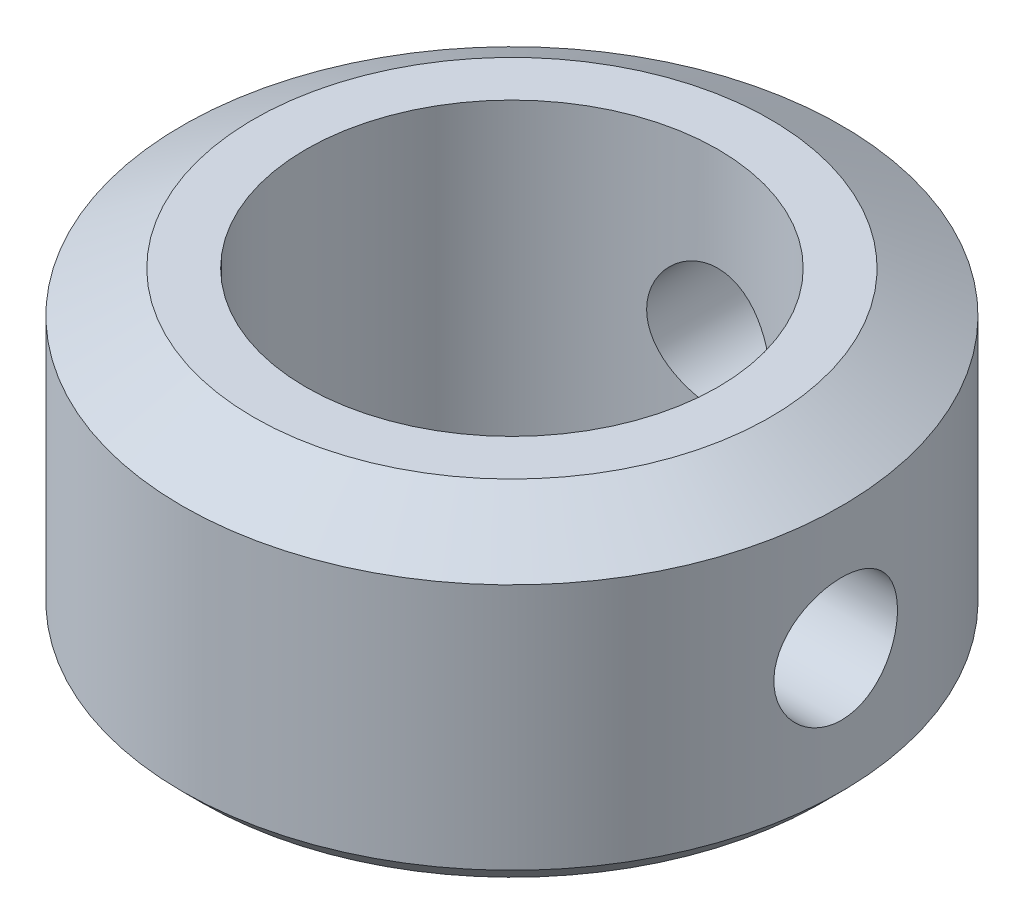
ISO-10303-21;
HEADER;
FILE_DESCRIPTION(('STEP AP214'),'2;1');
FILE_NAME('part.step','',(''),(''),'','','');
FILE_SCHEMA(('AUTOMOTIVE_DESIGN { 1 0 10303 214 1 1 1 1 }'));
ENDSEC;
DATA;
#1=APPLICATION_CONTEXT('core data for automotive mechanical design processes');
#2=APPLICATION_PROTOCOL_DEFINITION('international standard','automotive_design',2000,#1);
#3=PRODUCT_CONTEXT('',#1,'mechanical');
#4=PRODUCT('Part','Part','',(#3));
#5=PRODUCT_RELATED_PRODUCT_CATEGORY('part','',(#4));
#6=PRODUCT_DEFINITION_FORMATION('','',#4);
#7=PRODUCT_DEFINITION_CONTEXT('part definition',#1,'design');
#8=PRODUCT_DEFINITION('design','',#6,#7);
#9=PRODUCT_DEFINITION_SHAPE('','',#8);
#10=(LENGTH_UNIT() NAMED_UNIT(*) SI_UNIT(.MILLI.,.METRE.));
#11=(NAMED_UNIT(*) PLANE_ANGLE_UNIT() SI_UNIT($,.RADIAN.));
#12=(NAMED_UNIT(*) SI_UNIT($,.STERADIAN.) SOLID_ANGLE_UNIT());
#13=UNCERTAINTY_MEASURE_WITH_UNIT(LENGTH_MEASURE(1.E-05),#10,'distance_accuracy_value','');
#14=(GEOMETRIC_REPRESENTATION_CONTEXT(3) GLOBAL_UNCERTAINTY_ASSIGNED_CONTEXT((#13)) GLOBAL_UNIT_ASSIGNED_CONTEXT((#10,
#11,#12)) REPRESENTATION_CONTEXT('',''));
#15=CARTESIAN_POINT('',(0.,0.,0.));
#16=DIRECTION('',(0.,0.,1.));
#17=DIRECTION('',(1.,0.,0.));
#18=AXIS2_PLACEMENT_3D('',#15,#16,#17);
#19=CARTESIAN_POINT('',(0.,7.5,0.));
#20=DIRECTION('',(0.,1.,0.));
#21=DIRECTION('',(0.,0.,1.));
#22=AXIS2_PLACEMENT_3D('',#19,#20,#21);
#23=PLANE('',#22);
#24=CARTESIAN_POINT('',(0.,7.5,0.));
#25=DIRECTION('',(0.,1.,0.));
#26=DIRECTION('',(0.,0.,1.));
#27=AXIS2_PLACEMENT_3D('',#24,#25,#26);
#28=CIRCLE('',#27,6.26794919243112);
#29=CARTESIAN_POINT('',(0.,7.5,6.26794919243112));
#30=VERTEX_POINT('',#29);
#31=EDGE_CURVE('E54',#30,#30,#28,.T.);
#32=ORIENTED_EDGE('',*,*,#31,.T.);
#33=EDGE_LOOP('',(#32));
#34=FACE_BOUND('',#33,.T.);
#35=CARTESIAN_POINT('',(0.,7.5,0.));
#36=DIRECTION('',(0.,1.,0.));
#37=DIRECTION('',(0.,0.,1.));
#38=AXIS2_PLACEMENT_3D('',#35,#36,#37);
#39=CIRCLE('',#38,5.);
#40=CARTESIAN_POINT('',(0.,7.5,5.));
#41=VERTEX_POINT('',#40);
#42=EDGE_CURVE('E57',#41,#41,#39,.T.);
#43=ORIENTED_EDGE('',*,*,#42,.F.);
#44=EDGE_LOOP('',(#43));
#45=FACE_BOUND('',#44,.T.);
#46=ADVANCED_FACE('F31',(#34,#45),#23,.T.);
#47=CARTESIAN_POINT('',(0.,0.,0.));
#48=DIRECTION('',(0.,1.,0.));
#49=DIRECTION('',(0.,0.,1.));
#50=AXIS2_PLACEMENT_3D('',#47,#48,#49);
#51=PLANE('',#50);
#52=CARTESIAN_POINT('',(0.,0.,0.));
#53=DIRECTION('',(0.,1.,0.));
#54=DIRECTION('',(0.,0.,1.));
#55=AXIS2_PLACEMENT_3D('',#52,#53,#54);
#56=CIRCLE('',#55,5.2);
#57=CARTESIAN_POINT('',(0.,0.,5.2));
#58=VERTEX_POINT('',#57);
#59=EDGE_CURVE('E38',#58,#58,#56,.T.);
#60=ORIENTED_EDGE('',*,*,#59,.T.);
#61=EDGE_LOOP('',(#60));
#62=FACE_BOUND('',#61,.T.);
#63=CARTESIAN_POINT('',(0.,0.,0.));
#64=DIRECTION('',(0.,1.,0.));
#65=DIRECTION('',(0.,0.,1.));
#66=AXIS2_PLACEMENT_3D('',#63,#64,#65);
#67=CIRCLE('',#66,7.5);
#68=CARTESIAN_POINT('',(0.,0.,7.5));
#69=VERTEX_POINT('',#68);
#70=EDGE_CURVE('E42',#69,#69,#67,.F.);
#71=ORIENTED_EDGE('',*,*,#70,.T.);
#72=EDGE_LOOP('',(#71));
#73=FACE_BOUND('',#72,.T.);
#74=ADVANCED_FACE('F106',(#62,#73),#51,.F.);
#75=CARTESIAN_POINT('',(0.,7.5,0.));
#76=DIRECTION('',(0.,-1.,0.));
#77=DIRECTION('',(0.,0.,-1.));
#78=AXIS2_PLACEMENT_3D('',#75,#76,#77);
#79=CYLINDRICAL_SURFACE('',#78,8.);
#80=CARTESIAN_POINT('',(-1.50000000000003,3.5,-7.85811682275085));
#81=CARTESIAN_POINT('',(-1.49999679883248,3.58345720801174,-7.85811843793493));
#82=CARTESIAN_POINT('',(-1.49301126348939,3.66695594821839,-7.85946079760266));
#83=CARTESIAN_POINT('',(-1.46527253251808,3.83159896158191,-7.86467851014364));
#84=CARTESIAN_POINT('',(-1.4445076576848,3.91274117642748,-7.86855601173205));
#85=CARTESIAN_POINT('',(-1.3898703561779,4.07026507137087,-7.87838976464884));
#86=CARTESIAN_POINT('',(-1.35601013954377,4.14665110930729,-7.88434407905997));
#87=CARTESIAN_POINT('',(-1.27617565760369,4.29265355928681,-7.89765826320959));
#88=CARTESIAN_POINT('',(-1.23020233759196,4.3622704990033,-7.90501802325621));
#89=CARTESIAN_POINT('',(-1.12683678942625,4.49363019919913,-7.92041614838944));
#90=CARTESIAN_POINT('',(-1.06932292933094,4.55527648347173,-7.92846116625679));
#91=CARTESIAN_POINT('',(-0.944771778803578,4.66810438959956,-7.94426457664033));
#92=CARTESIAN_POINT('',(-0.877733863624972,4.71928532442479,-7.95202295031152));
#93=CARTESIAN_POINT('',(-0.735403894570189,4.81009937660052,-7.96645017828405));
#94=CARTESIAN_POINT('',(-0.660052840033892,4.84964153351942,-7.97311028052363));
#95=CARTESIAN_POINT('',(-0.503631283250789,4.91546954227353,-7.9845160863293));
#96=CARTESIAN_POINT('',(-0.422561251859532,4.94175648399022,-7.98926194728334));
#97=CARTESIAN_POINT('',(-0.258002746187443,4.98002954861113,-7.99625755123778));
#98=CARTESIAN_POINT('',(-0.174553323244884,4.99217830592268,-7.99853565976327));
#99=CARTESIAN_POINT('',(-0.00677167603540987,5.0023368877004,-8.00043684615594));
#100=CARTESIAN_POINT('',(0.0775604724476434,5.00034791613906,-8.00006015010697));
#101=CARTESIAN_POINT('',(0.24359835789937,4.98241222885285,-7.99671633763241));
#102=CARTESIAN_POINT('',(0.325323760451442,4.96664063056999,-7.99378172247214));
#103=CARTESIAN_POINT('',(0.484947165715449,4.92186435060476,-7.98568826333561));
#104=CARTESIAN_POINT('',(0.562845028826514,4.89285918665419,-7.98052933829966));
#105=CARTESIAN_POINT('',(0.713110065751494,4.8222722689417,-7.9685126029734));
#106=CARTESIAN_POINT('',(0.785443571838506,4.7806205120875,-7.96164537590826));
#107=CARTESIAN_POINT('',(0.922159977214611,4.68597433092284,-7.9469714754285));
#108=CARTESIAN_POINT('',(0.986542066910758,4.63297875311242,-7.93916470651164));
#109=CARTESIAN_POINT('',(1.10656561896901,4.51618429701647,-7.92333513680567));
#110=CARTESIAN_POINT('',(1.16205790757039,4.45223221609792,-7.91531085901622));
#111=CARTESIAN_POINT('',(1.26155171851258,4.31585046872137,-7.90006508924621));
#112=CARTESIAN_POINT('',(1.30555307271179,4.24342067823536,-7.89284360901351));
#113=CARTESIAN_POINT('',(1.38085852224475,4.09194172929734,-7.88001893307122));
#114=CARTESIAN_POINT('',(1.41214093645419,4.01288154280935,-7.87441850530262));
#115=CARTESIAN_POINT('',(1.46093656975053,3.8504988158768,-7.8655124239669));
#116=CARTESIAN_POINT('',(1.47845134901105,3.76717675953521,-7.8622065103862));
#117=CARTESIAN_POINT('',(1.49899672649736,3.59998067114412,-7.85831520301006));
#118=CARTESIAN_POINT('',(1.50224164285856,3.51613388443448,-7.85768955816137));
#119=CARTESIAN_POINT('',(1.49472968881722,3.34909654491285,-7.85912191420841));
#120=CARTESIAN_POINT('',(1.4839735108643,3.26590595985191,-7.86117978238612));
#121=CARTESIAN_POINT('',(1.4489486819588,3.10324709694561,-7.86770980063206));
#122=CARTESIAN_POINT('',(1.42479238583987,3.0237537473751,-7.87216186690879));
#123=CARTESIAN_POINT('',(1.36377224379057,2.86994281026984,-7.88296134156619));
#124=CARTESIAN_POINT('',(1.32690746128792,2.79562560468467,-7.88930888963282));
#125=CARTESIAN_POINT('',(1.24102353119657,2.65333238095683,-7.90327577863686));
#126=CARTESIAN_POINT('',(1.19186899639618,2.58543946213392,-7.91090895425316));
#127=CARTESIAN_POINT('',(1.08298344344244,2.45878795978567,-7.92654811368101));
#128=CARTESIAN_POINT('',(1.02325147433081,2.40003019844422,-7.93455413096494));
#129=CARTESIAN_POINT('',(0.893949417870357,2.29251623646587,-7.95016624005946));
#130=CARTESIAN_POINT('',(0.824258534095862,2.24390417339403,-7.95776555833305));
#131=CARTESIAN_POINT('',(0.677574523040111,2.15907879382233,-7.97159404810351));
#132=CARTESIAN_POINT('',(0.6005816770385,2.12286499997499,-7.97782327234725));
#133=CARTESIAN_POINT('',(0.441877541578655,2.06407990213592,-7.98818057995848));
#134=CARTESIAN_POINT('',(0.360193213078959,2.04143781243859,-7.99231954730142));
#135=CARTESIAN_POINT('',(0.194096227381542,2.01021295171011,-7.99807642083745));
#136=CARTESIAN_POINT('',(0.109683858215822,2.00162870133729,-7.99969459229933));
#137=CARTESIAN_POINT('',(-0.058090760250538,1.99881469848156,-8.00022227515441));
#138=CARTESIAN_POINT('',(-0.141449307066297,2.00436724687047,-7.99917286625032));
#139=CARTESIAN_POINT('',(-0.306023369279228,2.02919242776843,-7.99456866611703));
#140=CARTESIAN_POINT('',(-0.387238905213718,2.04846492874421,-7.99101389890671));
#141=CARTESIAN_POINT('',(-0.545106475595513,2.10009120738372,-7.98179837978045));
#142=CARTESIAN_POINT('',(-0.621766319318252,2.13242181288101,-7.97614135981576));
#143=CARTESIAN_POINT('',(-0.768605631316723,2.20922045365518,-7.96333372068771));
#144=CARTESIAN_POINT('',(-0.838784665003299,2.25368930210665,-7.95618300146483));
#145=CARTESIAN_POINT('',(-0.971755027780035,2.35425145444232,-7.94104779859941));
#146=CARTESIAN_POINT('',(-1.03442623539056,2.4105020338617,-7.93305284591271));
#147=CARTESIAN_POINT('',(-1.14951536065488,2.53270456249271,-7.91719633538833));
#148=CARTESIAN_POINT('',(-1.20193086324783,2.59865879037372,-7.90933480936764));
#149=CARTESIAN_POINT('',(-1.29547633945388,2.73912645470334,-7.89455577425925));
#150=CARTESIAN_POINT('',(-1.33649740531875,2.81371343966764,-7.88764767280728));
#151=CARTESIAN_POINT('',(-1.40536132423419,2.96882578997974,-7.87567084650032));
#152=CARTESIAN_POINT('',(-1.43321661638915,3.04934546658938,-7.87060038649116));
#153=CARTESIAN_POINT('',(-1.46929726596178,3.19175228806591,-7.86393016292124));
#154=CARTESIAN_POINT('',(-1.48079105739853,3.25280572376194,-7.86176310717932));
#155=CARTESIAN_POINT('',(-1.49614351076218,3.37589846842032,-7.85885585595504));
#156=CARTESIAN_POINT('',(-1.5000023805213,3.43793775050033,-7.85811562163282));
#157=CARTESIAN_POINT('',(-1.50000000000003,3.5,-7.85811682275085));
#158=B_SPLINE_CURVE_WITH_KNOTS('',3,(#80,#81,#82,#83,#84,#85,#86,#87,#88,#89,#90,#91,#92,#93,
#94,#95,#96,#97,#98,#99,#100,#101,#102,#103,#104,#105,#106,#107,#108,#109,#110,#111,#112,#113,
#114,#115,#116,#117,#118,#119,#120,#121,#122,#123,#124,#125,#126,#127,#128,#129,#130,#131,#132,
#133,#134,#135,#136,#137,#138,#139,#140,#141,#142,#143,#144,#145,#146,#147,#148,#149,#150,#151,
#152,#153,#154,#155,#156,#157),.UNSPECIFIED.,.T.,.F.,(4,2,2,2,2,2,2,2,2,2,2,2,2,2,2,2,2,2,2,2,2,
2,2,2,2,2,2,2,2,2,2,2,2,2,2,2,2,2,4),(0.,0.250144505793186,0.500501302380393,0.750625227978433,
1.00072963993908,1.25362335698691,1.50653367069315,1.76137104348047,2.0161874593964,
2.26804275460261,2.51987660200648,2.76855650598725,3.01724547328425,3.26733691984219,
3.51745380911785,3.77140614764064,4.025362201924,4.27974936118266,4.53410768866488,
4.78463248587075,5.03514489338718,5.28358792315369,5.53204926624317,5.78337862654143,
6.03473059394677,6.28944125495871,6.54414210821705,6.79750269418683,7.0508366166733,
7.30029300570138,7.54974700322167,7.79876026530358,8.0477902135711,8.30038464008745,
8.55303847730765,8.80803001818118,9.06278015749119,9.24880307527215,9.43482092920425),.UNSPECIFIED.);
#159=CARTESIAN_POINT('',(-1.50000000000003,3.5,-7.85811682275085));
#160=VERTEX_POINT('',#159);
#161=EDGE_CURVE('E87',#160,#160,#158,.T.);
#162=ORIENTED_EDGE('',*,*,#161,.F.);
#163=EDGE_LOOP('',(#162));
#164=FACE_BOUND('',#163,.T.);
#165=CARTESIAN_POINT('',(7.85811682275086,3.5,-1.5));
#166=CARTESIAN_POINT('',(7.85811843793494,3.58345720801174,-1.49999679883246));
#167=CARTESIAN_POINT('',(7.85946079760266,3.66695594821839,-1.49301126348936));
#168=CARTESIAN_POINT('',(7.86467851014364,3.83159896158191,-1.46527253251805));
#169=CARTESIAN_POINT('',(7.86855601173205,3.91274117642748,-1.44450765768477));
#170=CARTESIAN_POINT('',(7.87838976464885,4.07026507137087,-1.38987035617788));
#171=CARTESIAN_POINT('',(7.88434407905997,4.14665110930729,-1.35601013954374));
#172=CARTESIAN_POINT('',(7.89765826320959,4.29265355928681,-1.27617565760366));
#173=CARTESIAN_POINT('',(7.90501802325622,4.3622704990033,-1.23020233759193));
#174=CARTESIAN_POINT('',(7.92041614838944,4.49363019919913,-1.12683678942622));
#175=CARTESIAN_POINT('',(7.92846116625679,4.55527648347173,-1.06932292933092));
#176=CARTESIAN_POINT('',(7.94426457664034,4.66810438959956,-0.944771778803551));
#177=CARTESIAN_POINT('',(7.95202295031153,4.71928532442479,-0.877733863624944));
#178=CARTESIAN_POINT('',(7.96645017828405,4.81009937660052,-0.735403894570161));
#179=CARTESIAN_POINT('',(7.97311028052363,4.84964153351942,-0.660052840033864));
#180=CARTESIAN_POINT('',(7.98451608632931,4.91546954227353,-0.503631283250761));
#181=CARTESIAN_POINT('',(7.98926194728334,4.94175648399022,-0.422561251859505));
#182=CARTESIAN_POINT('',(7.99625755123778,4.98002954861113,-0.258002746187415));
#183=CARTESIAN_POINT('',(7.99853565976327,4.99217830592268,-0.174553323244856));
#184=CARTESIAN_POINT('',(8.00043684615594,5.0023368877004,-0.00677167603538234));
#185=CARTESIAN_POINT('',(8.00006015010697,5.00034791613906,0.077560472447671));
#186=CARTESIAN_POINT('',(7.99671633763241,4.98241222885285,0.243598357899397));
#187=CARTESIAN_POINT('',(7.99378172247214,4.96664063056999,0.32532376045147));
#188=CARTESIAN_POINT('',(7.98568826333561,4.92186435060476,0.484947165715476));
#189=CARTESIAN_POINT('',(7.98052933829966,4.89285918665419,0.562845028826541));
#190=CARTESIAN_POINT('',(7.96851260297339,4.8222722689417,0.713110065751522));
#191=CARTESIAN_POINT('',(7.96164537590825,4.7806205120875,0.785443571838533));
#192=CARTESIAN_POINT('',(7.9469714754285,4.68597433092285,0.922159977214638));
#193=CARTESIAN_POINT('',(7.93916470651164,4.63297875311242,0.986542066910785));
#194=CARTESIAN_POINT('',(7.92333513680567,4.51618429701647,1.10656561896904));
#195=CARTESIAN_POINT('',(7.91531085901621,4.45223221609792,1.16205790757041));
#196=CARTESIAN_POINT('',(7.9000650892462,4.31585046872137,1.26155171851261));
#197=CARTESIAN_POINT('',(7.89284360901351,4.24342067823536,1.30555307271182));
#198=CARTESIAN_POINT('',(7.88001893307121,4.09194172929734,1.38085852224478));
#199=CARTESIAN_POINT('',(7.87441850530261,4.01288154280935,1.41214093645421));
#200=CARTESIAN_POINT('',(7.86551242396689,3.8504988158768,1.46093656975056));
#201=CARTESIAN_POINT('',(7.8622065103862,3.76717675953521,1.47845134901108));
#202=CARTESIAN_POINT('',(7.85831520301005,3.59998067114412,1.49899672649739));
#203=CARTESIAN_POINT('',(7.85768955816136,3.51613388443448,1.50224164285859));
#204=CARTESIAN_POINT('',(7.8591219142084,3.34909654491285,1.49472968881724));
#205=CARTESIAN_POINT('',(7.86117978238611,3.26590595985191,1.48397351086433));
#206=CARTESIAN_POINT('',(7.86770980063205,3.10324709694561,1.44894868195883));
#207=CARTESIAN_POINT('',(7.87216186690878,3.0237537473751,1.4247923858399));
#208=CARTESIAN_POINT('',(7.88296134156619,2.86994281026984,1.3637722437906));
#209=CARTESIAN_POINT('',(7.88930888963281,2.79562560468467,1.32690746128795));
#210=CARTESIAN_POINT('',(7.90327577863685,2.65333238095683,1.2410235311966));
#211=CARTESIAN_POINT('',(7.91090895425315,2.58543946213393,1.19186899639621));
#212=CARTESIAN_POINT('',(7.926548113681,2.45878795978567,1.08298344344247));
#213=CARTESIAN_POINT('',(7.93455413096494,2.40003019844423,1.02325147433084));
#214=CARTESIAN_POINT('',(7.95016624005946,2.29251623646587,0.893949417870385));
#215=CARTESIAN_POINT('',(7.95776555833305,2.24390417339403,0.82425853409589));
#216=CARTESIAN_POINT('',(7.97159404810351,2.15907879382233,0.67757452304014));
#217=CARTESIAN_POINT('',(7.97782327234725,2.12286499997499,0.600581677038528));
#218=CARTESIAN_POINT('',(7.98818057995848,2.06407990213592,0.441877541578684));
#219=CARTESIAN_POINT('',(7.99231954730142,2.04143781243859,0.360193213078987));
#220=CARTESIAN_POINT('',(7.99807642083745,2.01021295171011,0.19409622738157));
#221=CARTESIAN_POINT('',(7.99969459229933,2.00162870133729,0.10968385821585));
#222=CARTESIAN_POINT('',(8.00022227515441,1.99881469848156,-0.0580907602505099));
#223=CARTESIAN_POINT('',(7.99917286625032,2.00436724687047,-0.141449307066269));
#224=CARTESIAN_POINT('',(7.99456866611703,2.02919242776843,-0.3060233692792));
#225=CARTESIAN_POINT('',(7.99101389890671,2.04846492874421,-0.38723890521369));
#226=CARTESIAN_POINT('',(7.98179837978045,2.10009120738372,-0.545106475595485));
#227=CARTESIAN_POINT('',(7.97614135981576,2.13242181288101,-0.621766319318224));
#228=CARTESIAN_POINT('',(7.96333372068771,2.20922045365518,-0.768605631316695));
#229=CARTESIAN_POINT('',(7.95618300146483,2.25368930210665,-0.838784665003271));
#230=CARTESIAN_POINT('',(7.94104779859941,2.35425145444232,-0.971755027780007));
#231=CARTESIAN_POINT('',(7.93305284591272,2.4105020338617,-1.03442623539053));
#232=CARTESIAN_POINT('',(7.91719633538833,2.53270456249271,-1.14951536065485));
#233=CARTESIAN_POINT('',(7.90933480936765,2.59865879037372,-1.2019308632478));
#234=CARTESIAN_POINT('',(7.89455577425926,2.73912645470334,-1.29547633945385));
#235=CARTESIAN_POINT('',(7.88764767280729,2.81371343966764,-1.33649740531872));
#236=CARTESIAN_POINT('',(7.87567084650033,2.96882578997974,-1.40536132423417));
#237=CARTESIAN_POINT('',(7.87060038649116,3.04934546658938,-1.43321661638912));
#238=CARTESIAN_POINT('',(7.86393016292125,3.19175228806591,-1.46929726596175));
#239=CARTESIAN_POINT('',(7.86176310717932,3.25280572376194,-1.4807910573985));
#240=CARTESIAN_POINT('',(7.85885585595504,3.37589846842032,-1.49614351076215));
#241=CARTESIAN_POINT('',(7.85811562163282,3.43793775050033,-1.50000238052127));
#242=CARTESIAN_POINT('',(7.85811682275086,3.5,-1.5));
#243=B_SPLINE_CURVE_WITH_KNOTS('',3,(#165,#166,#167,#168,#169,#170,#171,#172,#173,#174,#175,
#176,#177,#178,#179,#180,#181,#182,#183,#184,#185,#186,#187,#188,#189,#190,#191,#192,#193,#194,
#195,#196,#197,#198,#199,#200,#201,#202,#203,#204,#205,#206,#207,#208,#209,#210,#211,#212,#213,
#214,#215,#216,#217,#218,#219,#220,#221,#222,#223,#224,#225,#226,#227,#228,#229,#230,#231,#232,
#233,#234,#235,#236,#237,#238,#239,#240,#241,#242),.UNSPECIFIED.,.T.,.F.,(4,2,2,2,2,2,2,2,2,2,2,
2,2,2,2,2,2,2,2,2,2,2,2,2,2,2,2,2,2,2,2,2,2,2,2,2,2,2,4),(0.,0.250144505793187,
0.500501302380393,0.750625227978433,1.00072963993908,1.25362335698691,1.50653367069315,
1.76137104348047,2.0161874593964,2.26804275460261,2.51987660200648,2.76855650598725,
3.01724547328425,3.26733691984219,3.51745380911785,3.77140614764064,4.025362201924,
4.27974936118267,4.53410768866488,4.78463248587075,5.03514489338718,5.28358792315369,
5.53204926624317,5.78337862654143,6.03473059394677,6.28944125495871,6.54414210821705,
6.79750269418683,7.0508366166733,7.30029300570138,7.54974700322167,7.79876026530358,
8.0477902135711,8.30038464008745,8.55303847730765,8.80803001818118,9.06278015749119,
9.24880307527215,9.43482092920425),.UNSPECIFIED.);
#244=CARTESIAN_POINT('',(7.85811682275086,3.5,-1.5));
#245=VERTEX_POINT('',#244);
#246=EDGE_CURVE('E67',#245,#245,#243,.T.);
#247=ORIENTED_EDGE('',*,*,#246,.F.);
#248=EDGE_LOOP('',(#247));
#249=FACE_BOUND('',#248,.T.);
#250=CARTESIAN_POINT('',(0.,0.500000000000002,0.));
#251=DIRECTION('',(0.,1.,0.));
#252=DIRECTION('',(0.,0.,1.));
#253=AXIS2_PLACEMENT_3D('',#250,#251,#252);
#254=CIRCLE('',#253,8.);
#255=CARTESIAN_POINT('',(0.,0.500000000000002,8.));
#256=VERTEX_POINT('',#255);
#257=EDGE_CURVE('E46',#256,#256,#254,.T.);
#258=ORIENTED_EDGE('',*,*,#257,.T.);
#259=EDGE_LOOP('',(#258));
#260=FACE_BOUND('',#259,.T.);
#261=CARTESIAN_POINT('',(0.,6.5,0.));
#262=DIRECTION('',(0.,1.,0.));
#263=DIRECTION('',(0.,0.,1.));
#264=AXIS2_PLACEMENT_3D('',#261,#262,#263);
#265=CIRCLE('',#264,8.);
#266=CARTESIAN_POINT('',(0.,6.5,8.));
#267=VERTEX_POINT('',#266);
#268=EDGE_CURVE('E51',#267,#267,#265,.F.);
#269=ORIENTED_EDGE('',*,*,#268,.T.);
#270=EDGE_LOOP('',(#269));
#271=FACE_BOUND('',#270,.T.);
#272=ADVANCED_FACE('F102',(#164,#249,#260,#271),#79,.T.);
#273=CARTESIAN_POINT('',(0.,7.5,0.));
#274=DIRECTION('',(0.,-1.,0.));
#275=DIRECTION('',(0.,0.,-1.));
#276=AXIS2_PLACEMENT_3D('',#273,#274,#275);
#277=CYLINDRICAL_SURFACE('',#276,5.);
#278=CARTESIAN_POINT('',(-1.50000000000002,3.5,-4.76969600708472));
#279=CARTESIAN_POINT('',(-1.49999897633766,3.5821945479424,-4.76969685726979));
#280=CARTESIAN_POINT('',(-1.49322108167144,3.66439922414402,-4.77184390209068));
#281=CARTESIAN_POINT('',(-1.46635844446751,3.82640524959194,-4.78016578302899));
#282=CARTESIAN_POINT('',(-1.4462692557358,3.90620578650146,-4.78634196493467));
#283=CARTESIAN_POINT('',(-1.39352753269957,4.06103472827173,-4.80196102485632));
#284=CARTESIAN_POINT('',(-1.36089589394245,4.13607082963309,-4.81139846703232));
#285=CARTESIAN_POINT('',(-1.28406421917931,4.2796219339953,-4.83246932547566));
#286=CARTESIAN_POINT('',(-1.23986245137054,4.34813595868444,-4.84410307041019));
#287=CARTESIAN_POINT('',(-1.13964754141629,4.47886639057737,-4.86866862185765));
#288=CARTESIAN_POINT('',(-1.08333207175808,4.54084589794629,-4.88162808311635));
#289=CARTESIAN_POINT('',(-0.961136237579615,4.65463795132251,-4.90714861936757));
#290=CARTESIAN_POINT('',(-0.895254645461128,4.70644919044988,-4.91970964297705));
#291=CARTESIAN_POINT('',(-0.754111437793707,4.79946269983331,-4.94333214579389));
#292=CARTESIAN_POINT('',(-0.678684021335831,4.84042342444281,-4.95435724342404));
#293=CARTESIAN_POINT('',(-0.52162464536937,4.90898725904276,-4.97334435920684));
#294=CARTESIAN_POINT('',(-0.439994028387928,4.93659324985745,-4.98130703789495));
#295=CARTESIAN_POINT('',(-0.275323852630846,4.97688000109051,-4.99307646003589));
#296=CARTESIAN_POINT('',(-0.192391398953817,4.9899651276527,-4.99699557369338));
#297=CARTESIAN_POINT('',(-0.025421823749331,5.00211732464644,-5.00063201501348));
#298=CARTESIAN_POINT('',(0.0586150620503522,5.00118733940196,-5.00035022521079));
#299=CARTESIAN_POINT('',(0.222571156600144,4.98560713145697,-4.99569603817659));
#300=CARTESIAN_POINT('',(0.302536267641325,4.97139480619013,-4.9914542020526));
#301=CARTESIAN_POINT('',(0.45888921344251,4.93036866400571,-4.97951522112593));
#302=CARTESIAN_POINT('',(0.53527682132283,4.90355404905733,-4.97181785750586));
#303=CARTESIAN_POINT('',(0.683347326351264,4.83778797658144,-4.95365220986963));
#304=CARTESIAN_POINT('',(0.754965064694462,4.79869879719273,-4.94315269676706));
#305=CARTESIAN_POINT('',(0.89076467378314,4.70960214757177,-4.92049640648069));
#306=CARTESIAN_POINT('',(0.954944774872115,4.65959208703651,-4.90833923637778));
#307=CARTESIAN_POINT('',(1.07666048152978,4.5478022492484,-4.88311550488166));
#308=CARTESIAN_POINT('',(1.1338445804011,4.48564308097026,-4.87003195321461));
#309=CARTESIAN_POINT('',(1.23707651539822,4.35248998210995,-4.84483979887497));
#310=CARTESIAN_POINT('',(1.28312324482851,4.28149517461077,-4.8327312931702));
#311=CARTESIAN_POINT('',(1.36313995335449,4.13176053075101,-4.81077903197678));
#312=CARTESIAN_POINT('',(1.39698989237678,4.05295295413708,-4.80095810695957));
#313=CARTESIAN_POINT('',(1.45083362878412,3.89039279155445,-4.78496392548437));
#314=CARTESIAN_POINT('',(1.47083194640558,3.80664182846544,-4.7787894791583));
#315=CARTESIAN_POINT('',(1.49574770282163,3.63991763926072,-4.77104849541242));
#316=CARTESIAN_POINT('',(1.5011994638021,3.55703177610602,-4.76931878670441));
#317=CARTESIAN_POINT('',(1.49835947233061,3.39152709999013,-4.77021192441924));
#318=CARTESIAN_POINT('',(1.49006964371328,3.30890825126915,-4.7728341615659));
#319=CARTESIAN_POINT('',(1.46045763574188,3.14851162202913,-4.78197558554913));
#320=CARTESIAN_POINT('',(1.43947961431279,3.07066383573647,-4.78839176507489));
#321=CARTESIAN_POINT('',(1.38548577747938,2.91959830918508,-4.80429141231228));
#322=CARTESIAN_POINT('',(1.35246810342758,2.84638128585943,-4.81377535359074));
#323=CARTESIAN_POINT('',(1.27431871196499,2.70448253592787,-4.83505835023048));
#324=CARTESIAN_POINT('',(1.22888564172727,2.63597527901421,-4.84691271069799));
#325=CARTESIAN_POINT('',(1.12755301600383,2.50736189381919,-4.87148205646988));
#326=CARTESIAN_POINT('',(1.07165095534895,2.44725778238721,-4.88419724730004));
#327=CARTESIAN_POINT('',(0.948455132493581,2.33481959418526,-4.90963633548158));
#328=CARTESIAN_POINT('',(0.880811065857416,2.28286437101302,-4.92234245063004));
#329=CARTESIAN_POINT('',(0.737461784590231,2.19103329897225,-4.94584851748651));
#330=CARTESIAN_POINT('',(0.661756970543925,2.15115685021854,-4.95664856384717));
#331=CARTESIAN_POINT('',(0.504935504705203,2.0849999694317,-4.97505970474957));
#332=CARTESIAN_POINT('',(0.42386462203782,2.05861798384102,-4.98269453424966));
#333=CARTESIAN_POINT('',(0.258169966504569,2.01993908110958,-4.99401979596827));
#334=CARTESIAN_POINT('',(0.173547217354744,2.00763813405158,-4.9977113567088));
#335=CARTESIAN_POINT('',(0.00665215388272419,1.9977769559455,-5.00066544081399));
#336=CARTESIAN_POINT('',(-0.0755851790862252,1.99966730459217,-5.00009305111322));
#337=CARTESIAN_POINT('',(-0.238519481164422,2.01682163249912,-4.99497264465037));
#338=CARTESIAN_POINT('',(-0.319216537346547,2.03208485348044,-4.99042485330462));
#339=CARTESIAN_POINT('',(-0.475935813041377,2.07521166139962,-4.97791168358326));
#340=CARTESIAN_POINT('',(-0.55199892735141,2.10293818064901,-4.96998352900866));
#341=CARTESIAN_POINT('',(-0.698433237752071,2.17008191450719,-4.9515294303945));
#342=CARTESIAN_POINT('',(-0.768803496050598,2.20950105028619,-4.94100305949946));
#343=CARTESIAN_POINT('',(-0.904301892420582,2.30037345743004,-4.91803965828228));
#344=CARTESIAN_POINT('',(-0.969190250076786,2.35217143000077,-4.90555226923559));
#345=CARTESIAN_POINT('',(-1.08953757134596,2.4657103883328,-4.88023537212333));
#346=CARTESIAN_POINT('',(-1.14499380960195,2.52745423789815,-4.86740576641079));
#347=CARTESIAN_POINT('',(-1.2465626939455,2.66134077831051,-4.84240680631318));
#348=CARTESIAN_POINT('',(-1.29234759757958,2.73373855339044,-4.83026852693485));
#349=CARTESIAN_POINT('',(-1.37104313528777,2.88555517416102,-4.80852547508792));
#350=CARTESIAN_POINT('',(-1.4039599555729,2.9649706236012,-4.79891948596955));
#351=CARTESIAN_POINT('',(-1.45301942532951,3.11974043160627,-4.78427816717594));
#352=CARTESIAN_POINT('',(-1.47058859011233,3.19460864693099,-4.7788615484052));
#353=CARTESIAN_POINT('',(-1.49407818835146,3.34631522249577,-4.77157042597166));
#354=CARTESIAN_POINT('',(-1.50000095706097,3.42315318464525,-4.7696952122143));
#355=CARTESIAN_POINT('',(-1.50000000000002,3.5,-4.76969600708472));
#356=B_SPLINE_CURVE_WITH_KNOTS('',3,(#278,#279,#280,#281,#282,#283,#284,#285,#286,#287,#288,
#289,#290,#291,#292,#293,#294,#295,#296,#297,#298,#299,#300,#301,#302,#303,#304,#305,#306,#307,
#308,#309,#310,#311,#312,#313,#314,#315,#316,#317,#318,#319,#320,#321,#322,#323,#324,#325,#326,
#327,#328,#329,#330,#331,#332,#333,#334,#335,#336,#337,#338,#339,#340,#341,#342,#343,#344,#345,
#346,#347,#348,#349,#350,#351,#352,#353,#354,#355),.UNSPECIFIED.,.T.,.F.,(4,2,2,2,2,2,2,2,2,2,2,
2,2,2,2,2,2,2,2,2,2,2,2,2,2,2,2,2,2,2,2,2,2,2,2,2,2,2,4),(0.,0.246300165915543,
0.492682641689001,0.738656414466194,0.984667025370102,1.23773150007984,1.49082847871273,
1.74915939273645,2.00743455587877,2.25832140149558,2.50915554101441,2.7520012599088,
2.99486235890376,3.24055209335676,3.48630016590831,3.74152147023278,3.99676812491863,
4.25446238246266,4.51207250628411,4.76008080790309,5.00805439107388,5.24958594938817,
5.49115481045787,5.73920731809388,5.98731925928923,6.24479506100602,6.50225807324202,
6.75775391814325,7.01317662321682,7.2587630391122,7.50433553047754,7.74727096872219,
7.99024634491378,8.24099627054488,8.4918185262989,8.75011639669147,9.00828993963944,
9.23861153857447,9.4688869503356),.UNSPECIFIED.);
#357=CARTESIAN_POINT('',(-1.50000000000002,3.5,-4.76969600708472));
#358=VERTEX_POINT('',#357);
#359=EDGE_CURVE('E90',#358,#358,#356,.T.);
#360=ORIENTED_EDGE('',*,*,#359,.T.);
#361=EDGE_LOOP('',(#360));
#362=FACE_BOUND('',#361,.T.);
#363=CARTESIAN_POINT('',(4.76969600708473,3.5,-1.5));
#364=CARTESIAN_POINT('',(4.7696968572698,3.5821945479424,-1.49999897633764));
#365=CARTESIAN_POINT('',(4.77184390209069,3.66439922414402,-1.49322108167142));
#366=CARTESIAN_POINT('',(4.780165783029,3.82640524959194,-1.46635844446749));
#367=CARTESIAN_POINT('',(4.78634196493468,3.90620578650146,-1.44626925573578));
#368=CARTESIAN_POINT('',(4.80196102485633,4.06103472827173,-1.39352753269955));
#369=CARTESIAN_POINT('',(4.81139846703232,4.13607082963309,-1.36089589394243));
#370=CARTESIAN_POINT('',(4.83246932547567,4.2796219339953,-1.28406421917929));
#371=CARTESIAN_POINT('',(4.84410307041019,4.34813595868444,-1.23986245137053));
#372=CARTESIAN_POINT('',(4.86866862185765,4.47886639057737,-1.13964754141627));
#373=CARTESIAN_POINT('',(4.88162808311636,4.54084589794629,-1.08333207175807));
#374=CARTESIAN_POINT('',(4.90714861936757,4.65463795132251,-0.961136237579599));
#375=CARTESIAN_POINT('',(4.91970964297705,4.70644919044988,-0.895254645461111));
#376=CARTESIAN_POINT('',(4.94333214579389,4.79946269983331,-0.75411143779369));
#377=CARTESIAN_POINT('',(4.95435724342404,4.84042342444281,-0.678684021335814));
#378=CARTESIAN_POINT('',(4.97334435920684,4.90898725904276,-0.521624645369353));
#379=CARTESIAN_POINT('',(4.98130703789495,4.93659324985745,-0.439994028387911));
#380=CARTESIAN_POINT('',(4.99307646003589,4.97688000109051,-0.275323852630829));
#381=CARTESIAN_POINT('',(4.99699557369338,4.9899651276527,-0.1923913989538));
#382=CARTESIAN_POINT('',(5.00063201501348,5.00211732464644,-0.0254218237493144));
#383=CARTESIAN_POINT('',(5.00035022521079,5.00118733940196,0.0586150620503689));
#384=CARTESIAN_POINT('',(4.99569603817659,4.98560713145697,0.222571156600161));
#385=CARTESIAN_POINT('',(4.9914542020526,4.97139480619013,0.302536267641342));
#386=CARTESIAN_POINT('',(4.97951522112593,4.93036866400571,0.458889213442527));
#387=CARTESIAN_POINT('',(4.97181785750586,4.90355404905733,0.535276821322846));
#388=CARTESIAN_POINT('',(4.95365220986963,4.83778797658144,0.683347326351281));
#389=CARTESIAN_POINT('',(4.94315269676706,4.79869879719273,0.754965064694478));
#390=CARTESIAN_POINT('',(4.92049640648069,4.70960214757177,0.890764673783156));
#391=CARTESIAN_POINT('',(4.90833923637778,4.65959208703651,0.954944774872131));
#392=CARTESIAN_POINT('',(4.88311550488165,4.5478022492484,1.0766604815298));
#393=CARTESIAN_POINT('',(4.87003195321461,4.48564308097026,1.13384458040111));
#394=CARTESIAN_POINT('',(4.84483979887497,4.35248998210995,1.23707651539824));
#395=CARTESIAN_POINT('',(4.8327312931702,4.28149517461077,1.28312324482853));
#396=CARTESIAN_POINT('',(4.81077903197678,4.13176053075101,1.3631399533545));
#397=CARTESIAN_POINT('',(4.80095810695957,4.05295295413708,1.39698989237679));
#398=CARTESIAN_POINT('',(4.78496392548436,3.89039279155445,1.45083362878413));
#399=CARTESIAN_POINT('',(4.7787894791583,3.80664182846544,1.4708319464056));
#400=CARTESIAN_POINT('',(4.77104849541241,3.63991763926072,1.49574770282165));
#401=CARTESIAN_POINT('',(4.7693187867044,3.55703177610602,1.50119946380212));
#402=CARTESIAN_POINT('',(4.77021192441924,3.39152709999013,1.49835947233062));
#403=CARTESIAN_POINT('',(4.77283416156589,3.30890825126915,1.4900696437133));
#404=CARTESIAN_POINT('',(4.78197558554912,3.14851162202913,1.4604576357419));
#405=CARTESIAN_POINT('',(4.78839176507489,3.07066383573648,1.4394796143128));
#406=CARTESIAN_POINT('',(4.80429141231227,2.91959830918508,1.3854857774794));
#407=CARTESIAN_POINT('',(4.81377535359073,2.84638128585943,1.3524681034276));
#408=CARTESIAN_POINT('',(4.83505835023047,2.70448253592787,1.274318711965));
#409=CARTESIAN_POINT('',(4.84691271069799,2.63597527901421,1.22888564172729));
#410=CARTESIAN_POINT('',(4.87148205646987,2.5073618938192,1.12755301600385));
#411=CARTESIAN_POINT('',(4.88419724730003,2.44725778238721,1.07165095534897));
#412=CARTESIAN_POINT('',(4.90963633548158,2.33481959418526,0.948455132493598));
#413=CARTESIAN_POINT('',(4.92234245063004,2.28286437101302,0.880811065857434));
#414=CARTESIAN_POINT('',(4.94584851748651,2.19103329897225,0.737461784590248));
#415=CARTESIAN_POINT('',(4.95664856384717,2.15115685021854,0.661756970543943));
#416=CARTESIAN_POINT('',(4.97505970474957,2.0849999694317,0.504935504705221));
#417=CARTESIAN_POINT('',(4.98269453424966,2.05861798384102,0.423864622037839));
#418=CARTESIAN_POINT('',(4.99401979596827,2.01993908110958,0.258169966504588));
#419=CARTESIAN_POINT('',(4.9977113567088,2.00763813405158,0.173547217354762));
#420=CARTESIAN_POINT('',(5.00066544081399,1.9977769559455,0.00665215388274223));
#421=CARTESIAN_POINT('',(5.00009305111322,1.99966730459217,-0.0755851790862073));
#422=CARTESIAN_POINT('',(4.99497264465037,2.01682163249912,-0.238519481164404));
#423=CARTESIAN_POINT('',(4.99042485330463,2.03208485348044,-0.319216537346529));
#424=CARTESIAN_POINT('',(4.97791168358327,2.07521166139962,-0.475935813041359));
#425=CARTESIAN_POINT('',(4.96998352900866,2.10293818064901,-0.551998927351392));
#426=CARTESIAN_POINT('',(4.9515294303945,2.17008191450719,-0.698433237752053));
#427=CARTESIAN_POINT('',(4.94100305949946,2.20950105028619,-0.76880349605058));
#428=CARTESIAN_POINT('',(4.91803965828228,2.30037345743003,-0.904301892420563));
#429=CARTESIAN_POINT('',(4.90555226923559,2.35217143000077,-0.969190250076767));
#430=CARTESIAN_POINT('',(4.88023537212334,2.4657103883328,-1.08953757134594));
#431=CARTESIAN_POINT('',(4.86740576641079,2.52745423789815,-1.14499380960194));
#432=CARTESIAN_POINT('',(4.84240680631319,2.66134077831051,-1.24656269394549));
#433=CARTESIAN_POINT('',(4.83026852693485,2.73373855339044,-1.29234759757956));
#434=CARTESIAN_POINT('',(4.80852547508793,2.88555517416102,-1.37104313528776));
#435=CARTESIAN_POINT('',(4.79891948596955,2.96497062360119,-1.40395995557289));
#436=CARTESIAN_POINT('',(4.78427816717595,3.11974043160627,-1.4530194253295));
#437=CARTESIAN_POINT('',(4.7788615484052,3.19460864693099,-1.47058859011232));
#438=CARTESIAN_POINT('',(4.77157042597167,3.34631522249577,-1.49407818835144));
#439=CARTESIAN_POINT('',(4.7696952122143,3.42315318464525,-1.50000095706095));
#440=CARTESIAN_POINT('',(4.76969600708473,3.5,-1.5));
#441=B_SPLINE_CURVE_WITH_KNOTS('',3,(#363,#364,#365,#366,#367,#368,#369,#370,#371,#372,#373,
#374,#375,#376,#377,#378,#379,#380,#381,#382,#383,#384,#385,#386,#387,#388,#389,#390,#391,#392,
#393,#394,#395,#396,#397,#398,#399,#400,#401,#402,#403,#404,#405,#406,#407,#408,#409,#410,#411,
#412,#413,#414,#415,#416,#417,#418,#419,#420,#421,#422,#423,#424,#425,#426,#427,#428,#429,#430,
#431,#432,#433,#434,#435,#436,#437,#438,#439,#440),.UNSPECIFIED.,.T.,.F.,(4,2,2,2,2,2,2,2,2,2,2,
2,2,2,2,2,2,2,2,2,2,2,2,2,2,2,2,2,2,2,2,2,2,2,2,2,2,2,4),(0.,0.246300165915542,0.492682641689,
0.738656414466193,0.984667025370101,1.23773150007984,1.49082847871273,1.74915939273645,
2.00743455587877,2.25832140149558,2.5091555410144,2.7520012599088,2.99486235890376,
3.24055209335676,3.48630016590831,3.74152147023278,3.99676812491863,4.25446238246266,
4.51207250628411,4.76008080790309,5.00805439107388,5.24958594938817,5.49115481045787,
5.73920731809388,5.98731925928923,6.24479506100602,6.50225807324202,6.75775391814325,
7.01317662321682,7.2587630391122,7.50433553047754,7.74727096872219,7.99024634491378,
8.24099627054488,8.4918185262989,8.75011639669147,9.00828993963944,9.23861153857447,
9.4688869503356),.UNSPECIFIED.);
#442=CARTESIAN_POINT('',(4.76969600708473,3.5,-1.5));
#443=VERTEX_POINT('',#442);
#444=EDGE_CURVE('E60',#443,#443,#441,.T.);
#445=ORIENTED_EDGE('',*,*,#444,.T.);
#446=EDGE_LOOP('',(#445));
#447=FACE_BOUND('',#446,.T.);
#448=CARTESIAN_POINT('',(0.,0.200000000000001,0.));
#449=DIRECTION('',(0.,1.,0.));
#450=DIRECTION('',(0.,0.,1.));
#451=AXIS2_PLACEMENT_3D('',#448,#449,#450);
#452=CIRCLE('',#451,5.);
#453=CARTESIAN_POINT('',(0.,0.200000000000001,5.));
#454=VERTEX_POINT('',#453);
#455=EDGE_CURVE('E10',#454,#454,#452,.F.);
#456=ORIENTED_EDGE('',*,*,#455,.T.);
#457=EDGE_LOOP('',(#456));
#458=FACE_BOUND('',#457,.T.);
#459=ORIENTED_EDGE('',*,*,#42,.T.);
#460=EDGE_LOOP('',(#459));
#461=FACE_BOUND('',#460,.T.);
#462=ADVANCED_FACE('F105',(#362,#447,#458,#461),#277,.F.);
#463=CARTESIAN_POINT('',(0.,7.5,0.));
#464=DIRECTION('',(0.,-1.,0.));
#465=DIRECTION('',(0.,0.,-1.));
#466=AXIS2_PLACEMENT_3D('',#463,#464,#465);
#467=CONICAL_SURFACE('',#466,6.26794919243112,1.0471975511966);
#468=ORIENTED_EDGE('',*,*,#268,.F.);
#469=EDGE_LOOP('',(#468));
#470=FACE_BOUND('',#469,.T.);
#471=ORIENTED_EDGE('',*,*,#31,.F.);
#472=EDGE_LOOP('',(#471));
#473=FACE_BOUND('',#472,.T.);
#474=ADVANCED_FACE('F114',(#470,#473),#467,.T.);
#475=CARTESIAN_POINT('',(0.,0.500000000000002,0.));
#476=DIRECTION('',(0.,1.,0.));
#477=DIRECTION('',(0.,0.,1.));
#478=AXIS2_PLACEMENT_3D('',#475,#476,#477);
#479=CONICAL_SURFACE('',#478,8.,0.78539816339745);
#480=ORIENTED_EDGE('',*,*,#70,.F.);
#481=EDGE_LOOP('',(#480));
#482=FACE_BOUND('',#481,.T.);
#483=ORIENTED_EDGE('',*,*,#257,.F.);
#484=EDGE_LOOP('',(#483));
#485=FACE_BOUND('',#484,.T.);
#486=ADVANCED_FACE('F117',(#482,#485),#479,.T.);
#487=CARTESIAN_POINT('',(0.,0.,0.));
#488=DIRECTION('',(0.,-1.,0.));
#489=DIRECTION('',(0.,0.,-1.));
#490=AXIS2_PLACEMENT_3D('',#487,#488,#489);
#491=CONICAL_SURFACE('',#490,5.2,0.785398163397438);
#492=ORIENTED_EDGE('',*,*,#455,.F.);
#493=EDGE_LOOP('',(#492));
#494=FACE_BOUND('',#493,.T.);
#495=ORIENTED_EDGE('',*,*,#59,.F.);
#496=EDGE_LOOP('',(#495));
#497=FACE_BOUND('',#496,.T.);
#498=ADVANCED_FACE('F33',(#494,#497),#491,.F.);
#499=CARTESIAN_POINT('',(-8.001,3.5,0.));
#500=DIRECTION('',(1.,0.,0.));
#501=DIRECTION('',(0.,0.,-1.));
#502=AXIS2_PLACEMENT_3D('',#499,#500,#501);
#503=CYLINDRICAL_SURFACE('',#502,1.5);
#504=ORIENTED_EDGE('',*,*,#444,.F.);
#505=EDGE_LOOP('',(#504));
#506=FACE_BOUND('',#505,.T.);
#507=ORIENTED_EDGE('',*,*,#246,.T.);
#508=EDGE_LOOP('',(#507));
#509=FACE_BOUND('',#508,.T.);
#510=ADVANCED_FACE('F72',(#506,#509),#503,.F.);
#511=CARTESIAN_POINT('',(0.,3.5,8.00100000000003));
#512=DIRECTION('',(0.,0.,-1.));
#513=DIRECTION('',(-1.,0.,0.));
#514=AXIS2_PLACEMENT_3D('',#511,#512,#513);
#515=CYLINDRICAL_SURFACE('',#514,1.5);
#516=ORIENTED_EDGE('',*,*,#359,.F.);
#517=EDGE_LOOP('',(#516));
#518=FACE_BOUND('',#517,.T.);
#519=ORIENTED_EDGE('',*,*,#161,.T.);
#520=EDGE_LOOP('',(#519));
#521=FACE_BOUND('',#520,.T.);
#522=ADVANCED_FACE('F77',(#518,#521),#515,.F.);
#523=CLOSED_SHELL('',(#46,#74,#272,#462,#474,#486,#498,#510,#522));
#524=MANIFOLD_SOLID_BREP('B2',#523);
#525=ADVANCED_BREP_SHAPE_REPRESENTATION('',(#18,#524),#14);
#526=SHAPE_DEFINITION_REPRESENTATION(#9,#525);
ENDSEC;
END-ISO-10303-21;
